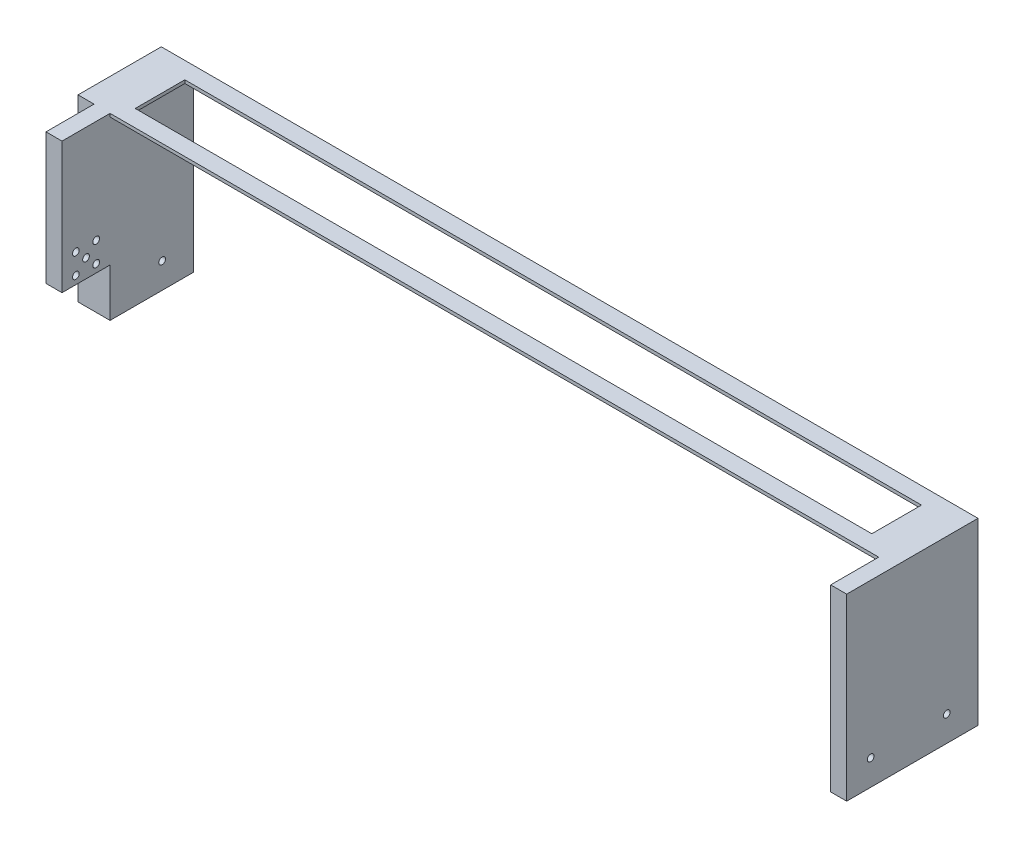
ISO-10303-21;
HEADER;
FILE_DESCRIPTION(('STEP AP214'),'2;1');
FILE_NAME('part.step','',(''),(''),'','','');
FILE_SCHEMA(('AUTOMOTIVE_DESIGN { 1 0 10303 214 1 1 1 1 }'));
ENDSEC;
DATA;
#1=APPLICATION_CONTEXT('core data for automotive mechanical design processes');
#2=APPLICATION_PROTOCOL_DEFINITION('international standard','automotive_design',2000,#1);
#3=PRODUCT_CONTEXT('',#1,'mechanical');
#4=PRODUCT('Part','Part','',(#3));
#5=PRODUCT_RELATED_PRODUCT_CATEGORY('part','',(#4));
#6=PRODUCT_DEFINITION_FORMATION('','',#4);
#7=PRODUCT_DEFINITION_CONTEXT('part definition',#1,'design');
#8=PRODUCT_DEFINITION('design','',#6,#7);
#9=PRODUCT_DEFINITION_SHAPE('','',#8);
#10=(LENGTH_UNIT() NAMED_UNIT(*) SI_UNIT(.MILLI.,.METRE.));
#11=(NAMED_UNIT(*) PLANE_ANGLE_UNIT() SI_UNIT($,.RADIAN.));
#12=(NAMED_UNIT(*) SI_UNIT($,.STERADIAN.) SOLID_ANGLE_UNIT());
#13=UNCERTAINTY_MEASURE_WITH_UNIT(LENGTH_MEASURE(1.E-05),#10,'distance_accuracy_value','');
#14=(GEOMETRIC_REPRESENTATION_CONTEXT(3) GLOBAL_UNCERTAINTY_ASSIGNED_CONTEXT((#13)) GLOBAL_UNIT_ASSIGNED_CONTEXT((#10,
#11,#12)) REPRESENTATION_CONTEXT('',''));
#15=CARTESIAN_POINT('',(0.,0.,0.));
#16=DIRECTION('',(0.,0.,1.));
#17=DIRECTION('',(1.,0.,0.));
#18=AXIS2_PLACEMENT_3D('',#15,#16,#17);
#19=CARTESIAN_POINT('',(0.,-0.001,0.));
#20=DIRECTION('',(0.,0.,1.));
#21=DIRECTION('',(1.,0.,0.));
#22=AXIS2_PLACEMENT_3D('',#19,#20,#21);
#23=PLANE('',#22);
#24=DIRECTION('',(0.,-1.,0.));
#25=VECTOR('',#24,1.);
#26=CARTESIAN_POINT('',(20.,-0.001,0.));
#27=LINE('',#26,#25);
#28=CARTESIAN_POINT('',(20.,79.999,0.));
#29=VERTEX_POINT('',#28);
#30=CARTESIAN_POINT('',(20.,-30.,0.));
#31=VERTEX_POINT('',#30);
#32=EDGE_CURVE('E234',#29,#31,#27,.T.);
#33=ORIENTED_EDGE('',*,*,#32,.T.);
#34=DIRECTION('',(-1.,0.,0.));
#35=VECTOR('',#34,1.);
#36=CARTESIAN_POINT('',(0.,-30.,0.));
#37=LINE('',#36,#35);
#38=CARTESIAN_POINT('',(0.,-30.,0.));
#39=VERTEX_POINT('',#38);
#40=EDGE_CURVE('E209',#31,#39,#37,.T.);
#41=ORIENTED_EDGE('',*,*,#40,.T.);
#42=DIRECTION('',(0.,1.,0.));
#43=VECTOR('',#42,1.);
#44=CARTESIAN_POINT('',(0.,-0.001,0.));
#45=LINE('',#44,#43);
#46=CARTESIAN_POINT('',(0.,82.,0.));
#47=VERTEX_POINT('',#46);
#48=EDGE_CURVE('E294',#39,#47,#45,.T.);
#49=ORIENTED_EDGE('',*,*,#48,.T.);
#50=DIRECTION('',(1.,0.,0.));
#51=VECTOR('',#50,1.);
#52=CARTESIAN_POINT('',(0.,82.,0.));
#53=LINE('',#52,#51);
#54=CARTESIAN_POINT('',(510.,82.,0.));
#55=VERTEX_POINT('',#54);
#56=EDGE_CURVE('E256',#47,#55,#53,.T.);
#57=ORIENTED_EDGE('',*,*,#56,.T.);
#58=DIRECTION('',(0.,1.,0.));
#59=VECTOR('',#58,1.);
#60=CARTESIAN_POINT('',(510.,-0.001,0.));
#61=LINE('',#60,#59);
#62=CARTESIAN_POINT('',(510.,-30.,0.));
#63=VERTEX_POINT('',#62);
#64=EDGE_CURVE('E292',#63,#55,#61,.T.);
#65=ORIENTED_EDGE('',*,*,#64,.F.);
#66=DIRECTION('',(-1.,0.,0.));
#67=VECTOR('',#66,1.);
#68=CARTESIAN_POINT('',(500.,-30.,0.));
#69=LINE('',#68,#67);
#70=CARTESIAN_POINT('',(500.,-30.,0.));
#71=VERTEX_POINT('',#70);
#72=EDGE_CURVE('E216',#63,#71,#69,.T.);
#73=ORIENTED_EDGE('',*,*,#72,.T.);
#74=DIRECTION('',(0.,1.,0.));
#75=VECTOR('',#74,1.);
#76=CARTESIAN_POINT('',(500.,79.999,0.));
#77=LINE('',#76,#75);
#78=CARTESIAN_POINT('',(500.,79.999,0.));
#79=VERTEX_POINT('',#78);
#80=EDGE_CURVE('E229',#71,#79,#77,.T.);
#81=ORIENTED_EDGE('',*,*,#80,.T.);
#82=DIRECTION('',(-1.,0.,0.));
#83=VECTOR('',#82,1.);
#84=CARTESIAN_POINT('',(20.,79.999,0.));
#85=LINE('',#84,#83);
#86=EDGE_CURVE('E231',#79,#29,#85,.T.);
#87=ORIENTED_EDGE('',*,*,#86,.T.);
#88=EDGE_LOOP('',(#33,#41,#49,#57,#65,#73,#81,#87));
#89=FACE_BOUND('',#88,.T.);
#90=ADVANCED_FACE('F39',(#89),#23,.F.);
#91=CARTESIAN_POINT('',(20.,-0.001,51.9999999999999));
#92=DIRECTION('',(0.,0.,1.));
#93=DIRECTION('',(1.,0.,0.));
#94=AXIS2_PLACEMENT_3D('',#91,#92,#93);
#95=PLANE('',#94);
#96=DIRECTION('',(0.,1.,0.));
#97=VECTOR('',#96,1.);
#98=CARTESIAN_POINT('',(20.,-0.001,51.9999999999999));
#99=LINE('',#98,#97);
#100=CARTESIAN_POINT('',(20.,79.999,51.9999999999999));
#101=VERTEX_POINT('',#100);
#102=CARTESIAN_POINT('',(20.,82.,51.9999999999999));
#103=VERTEX_POINT('',#102);
#104=EDGE_CURVE('E284',#101,#103,#99,.T.);
#105=ORIENTED_EDGE('',*,*,#104,.F.);
#106=DIRECTION('',(1.,0.,0.));
#107=VECTOR('',#106,1.);
#108=CARTESIAN_POINT('',(20.,79.999,51.9999999999999));
#109=LINE('',#108,#107);
#110=CARTESIAN_POINT('',(500.,79.999,51.9999999999999));
#111=VERTEX_POINT('',#110);
#112=EDGE_CURVE('E241',#101,#111,#109,.T.);
#113=ORIENTED_EDGE('',*,*,#112,.T.);
#114=DIRECTION('',(0.,1.,0.));
#115=VECTOR('',#114,1.);
#116=CARTESIAN_POINT('',(500.,-0.001,51.9999999999999));
#117=LINE('',#116,#115);
#118=CARTESIAN_POINT('',(500.,82.,51.9999999999999));
#119=VERTEX_POINT('',#118);
#120=EDGE_CURVE('E286',#111,#119,#117,.T.);
#121=ORIENTED_EDGE('',*,*,#120,.T.);
#122=DIRECTION('',(1.,0.,0.));
#123=VECTOR('',#122,1.);
#124=CARTESIAN_POINT('',(20.,82.,51.9999999999999));
#125=LINE('',#124,#123);
#126=EDGE_CURVE('E268',#103,#119,#125,.T.);
#127=ORIENTED_EDGE('',*,*,#126,.F.);
#128=EDGE_LOOP('',(#105,#113,#121,#127));
#129=FACE_BOUND('',#128,.T.);
#130=ADVANCED_FACE('F399',(#129),#95,.T.);
#131=CARTESIAN_POINT('',(0.,-0.001,0.));
#132=DIRECTION('',(0.,-1.,0.));
#133=DIRECTION('',(0.,0.,-1.));
#134=AXIS2_PLACEMENT_3D('',#131,#132,#133);
#135=PLANE('',#134);
#136=DIRECTION('',(-1.,0.,0.));
#137=VECTOR('',#136,1.);
#138=CARTESIAN_POINT('',(0.,-0.001,52.));
#139=LINE('',#138,#137);
#140=CARTESIAN_POINT('',(20.,-0.001,52.));
#141=VERTEX_POINT('',#140);
#142=CARTESIAN_POINT('',(10.,-0.001,52.));
#143=VERTEX_POINT('',#142);
#144=EDGE_CURVE('E215',#141,#143,#139,.T.);
#145=ORIENTED_EDGE('',*,*,#144,.F.);
#146=DIRECTION('',(0.,0.,-1.));
#147=VECTOR('',#146,1.);
#148=CARTESIAN_POINT('',(20.,-0.001,82.));
#149=LINE('',#148,#147);
#150=CARTESIAN_POINT('',(20.,-0.001,82.));
#151=VERTEX_POINT('',#150);
#152=EDGE_CURVE('E279',#151,#141,#149,.T.);
#153=ORIENTED_EDGE('',*,*,#152,.F.);
#154=DIRECTION('',(-1.,0.,0.));
#155=VECTOR('',#154,1.);
#156=CARTESIAN_POINT('',(20.,-0.001,82.));
#157=LINE('',#156,#155);
#158=CARTESIAN_POINT('',(10.,-0.001,82.));
#159=VERTEX_POINT('',#158);
#160=EDGE_CURVE('E274',#151,#159,#157,.T.);
#161=ORIENTED_EDGE('',*,*,#160,.T.);
#162=DIRECTION('',(0.,0.,-1.));
#163=VECTOR('',#162,1.);
#164=CARTESIAN_POINT('',(10.,-0.001,82.));
#165=LINE('',#164,#163);
#166=EDGE_CURVE('E277',#159,#143,#165,.T.);
#167=ORIENTED_EDGE('',*,*,#166,.T.);
#168=EDGE_LOOP('',(#145,#153,#161,#167));
#169=FACE_BOUND('',#168,.T.);
#170=ADVANCED_FACE('F403',(#169),#135,.T.);
#171=CARTESIAN_POINT('',(20.,-0.001,82.));
#172=DIRECTION('',(0.,0.,-1.));
#173=DIRECTION('',(-1.,0.,0.));
#174=AXIS2_PLACEMENT_3D('',#171,#172,#173);
#175=PLANE('',#174);
#176=DIRECTION('',(0.,1.,0.));
#177=VECTOR('',#176,1.);
#178=CARTESIAN_POINT('',(20.,-0.001,82.));
#179=LINE('',#178,#177);
#180=CARTESIAN_POINT('',(20.,82.,82.));
#181=VERTEX_POINT('',#180);
#182=EDGE_CURVE('E282',#151,#181,#179,.T.);
#183=ORIENTED_EDGE('',*,*,#182,.T.);
#184=DIRECTION('',(-1.,0.,0.));
#185=VECTOR('',#184,1.);
#186=CARTESIAN_POINT('',(20.,82.,82.));
#187=LINE('',#186,#185);
#188=CARTESIAN_POINT('',(10.,82.,82.));
#189=VERTEX_POINT('',#188);
#190=EDGE_CURVE('E244',#181,#189,#187,.T.);
#191=ORIENTED_EDGE('',*,*,#190,.T.);
#192=DIRECTION('',(0.,1.,0.));
#193=VECTOR('',#192,1.);
#194=CARTESIAN_POINT('',(10.,-0.001,82.));
#195=LINE('',#194,#193);
#196=EDGE_CURVE('E300',#159,#189,#195,.T.);
#197=ORIENTED_EDGE('',*,*,#196,.F.);
#198=ORIENTED_EDGE('',*,*,#160,.F.);
#199=EDGE_LOOP('',(#183,#191,#197,#198));
#200=FACE_BOUND('',#199,.T.);
#201=ADVANCED_FACE('F41',(#200),#175,.F.);
#202=CARTESIAN_POINT('',(10.,-0.001,82.));
#203=DIRECTION('',(1.,0.,0.));
#204=DIRECTION('',(0.,0.,-1.));
#205=AXIS2_PLACEMENT_3D('',#202,#203,#204);
#206=PLANE('',#205);
#207=CARTESIAN_POINT('',(10.,4.999,60.65));
#208=DIRECTION('',(1.,0.,0.));
#209=DIRECTION('',(0.,0.,-1.));
#210=AXIS2_PLACEMENT_3D('',#207,#208,#209);
#211=CIRCLE('',#210,2.09999999999999);
#212=CARTESIAN_POINT('',(10.,4.999,58.55));
#213=VERTEX_POINT('',#212);
#214=EDGE_CURVE('E325',#213,#213,#211,.T.);
#215=ORIENTED_EDGE('',*,*,#214,.T.);
#216=EDGE_LOOP('',(#215));
#217=FACE_BOUND('',#216,.T.);
#218=CARTESIAN_POINT('',(10.,4.999,73.35));
#219=DIRECTION('',(1.,0.,0.));
#220=DIRECTION('',(0.,0.,-1.));
#221=AXIS2_PLACEMENT_3D('',#218,#219,#220);
#222=CIRCLE('',#221,2.1);
#223=CARTESIAN_POINT('',(10.,4.999,71.25));
#224=VERTEX_POINT('',#223);
#225=EDGE_CURVE('E331',#224,#224,#222,.T.);
#226=ORIENTED_EDGE('',*,*,#225,.T.);
#227=EDGE_LOOP('',(#226));
#228=FACE_BOUND('',#227,.T.);
#229=CARTESIAN_POINT('',(10.,17.699,73.35));
#230=DIRECTION('',(1.,0.,0.));
#231=DIRECTION('',(0.,0.,-1.));
#232=AXIS2_PLACEMENT_3D('',#229,#230,#231);
#233=CIRCLE('',#232,2.09999999999999);
#234=CARTESIAN_POINT('',(10.,17.699,71.25));
#235=VERTEX_POINT('',#234);
#236=EDGE_CURVE('E337',#235,#235,#233,.T.);
#237=ORIENTED_EDGE('',*,*,#236,.T.);
#238=EDGE_LOOP('',(#237));
#239=FACE_BOUND('',#238,.T.);
#240=CARTESIAN_POINT('',(10.,17.699,60.65));
#241=DIRECTION('',(1.,0.,0.));
#242=DIRECTION('',(0.,0.,-1.));
#243=AXIS2_PLACEMENT_3D('',#240,#241,#242);
#244=CIRCLE('',#243,2.1);
#245=CARTESIAN_POINT('',(10.,17.699,58.55));
#246=VERTEX_POINT('',#245);
#247=EDGE_CURVE('E343',#246,#246,#244,.T.);
#248=ORIENTED_EDGE('',*,*,#247,.T.);
#249=EDGE_LOOP('',(#248));
#250=FACE_BOUND('',#249,.T.);
#251=CARTESIAN_POINT('',(10.,11.349,67.));
#252=DIRECTION('',(1.,0.,0.));
#253=DIRECTION('',(0.,0.,-1.));
#254=AXIS2_PLACEMENT_3D('',#251,#252,#253);
#255=CIRCLE('',#254,2.1);
#256=CARTESIAN_POINT('',(10.,11.349,64.9));
#257=VERTEX_POINT('',#256);
#258=EDGE_CURVE('E317',#257,#257,#255,.T.);
#259=ORIENTED_EDGE('',*,*,#258,.T.);
#260=EDGE_LOOP('',(#259));
#261=FACE_BOUND('',#260,.T.);
#262=ORIENTED_EDGE('',*,*,#196,.T.);
#263=DIRECTION('',(0.,0.,-1.));
#264=VECTOR('',#263,1.);
#265=CARTESIAN_POINT('',(10.,82.,82.));
#266=LINE('',#265,#264);
#267=CARTESIAN_POINT('',(10.,82.,52.));
#268=VERTEX_POINT('',#267);
#269=EDGE_CURVE('E247',#189,#268,#266,.T.);
#270=ORIENTED_EDGE('',*,*,#269,.T.);
#271=DIRECTION('',(0.,1.,0.));
#272=VECTOR('',#271,1.);
#273=CARTESIAN_POINT('',(10.,-0.001,52.));
#274=LINE('',#273,#272);
#275=EDGE_CURVE('E298',#143,#268,#274,.T.);
#276=ORIENTED_EDGE('',*,*,#275,.F.);
#277=ORIENTED_EDGE('',*,*,#166,.F.);
#278=EDGE_LOOP('',(#262,#270,#276,#277));
#279=FACE_BOUND('',#278,.T.);
#280=ADVANCED_FACE('F406',(#217,#228,#239,#250,#261,#279),#206,.F.);
#281=CARTESIAN_POINT('',(10.,-0.001,52.));
#282=DIRECTION('',(0.,0.,-1.));
#283=DIRECTION('',(-1.,0.,0.));
#284=AXIS2_PLACEMENT_3D('',#281,#282,#283);
#285=PLANE('',#284);
#286=DIRECTION('',(-1.,0.,0.));
#287=VECTOR('',#286,1.);
#288=CARTESIAN_POINT('',(10.,82.,52.));
#289=LINE('',#288,#287);
#290=CARTESIAN_POINT('',(0.,82.,52.));
#291=VERTEX_POINT('',#290);
#292=EDGE_CURVE('E250',#268,#291,#289,.T.);
#293=ORIENTED_EDGE('',*,*,#292,.T.);
#294=DIRECTION('',(0.,1.,0.));
#295=VECTOR('',#294,1.);
#296=CARTESIAN_POINT('',(0.,-0.001,52.));
#297=LINE('',#296,#295);
#298=CARTESIAN_POINT('',(0.,-30.,52.));
#299=VERTEX_POINT('',#298);
#300=EDGE_CURVE('E296',#299,#291,#297,.T.);
#301=ORIENTED_EDGE('',*,*,#300,.F.);
#302=DIRECTION('',(1.,0.,0.));
#303=VECTOR('',#302,1.);
#304=CARTESIAN_POINT('',(0.,-30.,52.));
#305=LINE('',#304,#303);
#306=CARTESIAN_POINT('',(20.,-30.,52.));
#307=VERTEX_POINT('',#306);
#308=EDGE_CURVE('E202',#299,#307,#305,.T.);
#309=ORIENTED_EDGE('',*,*,#308,.T.);
#310=DIRECTION('',(0.,1.,0.));
#311=VECTOR('',#310,1.);
#312=CARTESIAN_POINT('',(20.,-30.,52.));
#313=LINE('',#312,#311);
#314=EDGE_CURVE('E212',#307,#141,#313,.T.);
#315=ORIENTED_EDGE('',*,*,#314,.T.);
#316=ORIENTED_EDGE('',*,*,#144,.T.);
#317=ORIENTED_EDGE('',*,*,#275,.T.);
#318=EDGE_LOOP('',(#293,#301,#309,#315,#316,#317));
#319=FACE_BOUND('',#318,.T.);
#320=ADVANCED_FACE('F367',(#319),#285,.F.);
#321=CARTESIAN_POINT('',(0.,-0.001,52.));
#322=DIRECTION('',(1.,0.,0.));
#323=DIRECTION('',(0.,0.,-1.));
#324=AXIS2_PLACEMENT_3D('',#321,#322,#323);
#325=PLANE('',#324);
#326=CARTESIAN_POINT('',(0.,-14.05,19.5000000104647));
#327=DIRECTION('',(1.,0.,0.));
#328=DIRECTION('',(0.,0.,-1.));
#329=AXIS2_PLACEMENT_3D('',#326,#327,#328);
#330=CIRCLE('',#329,2.1);
#331=CARTESIAN_POINT('',(0.,-14.05,17.4000000104647));
#332=VERTEX_POINT('',#331);
#333=EDGE_CURVE('E195',#332,#332,#330,.T.);
#334=ORIENTED_EDGE('',*,*,#333,.T.);
#335=EDGE_LOOP('',(#334));
#336=FACE_BOUND('',#335,.T.);
#337=DIRECTION('',(0.,0.,-1.));
#338=VECTOR('',#337,1.);
#339=CARTESIAN_POINT('',(0.,82.,52.));
#340=LINE('',#339,#338);
#341=EDGE_CURVE('E253',#291,#47,#340,.T.);
#342=ORIENTED_EDGE('',*,*,#341,.T.);
#343=ORIENTED_EDGE('',*,*,#48,.F.);
#344=DIRECTION('',(0.,0.,1.));
#345=VECTOR('',#344,1.);
#346=CARTESIAN_POINT('',(0.,-30.,0.));
#347=LINE('',#346,#345);
#348=EDGE_CURVE('E199',#39,#299,#347,.T.);
#349=ORIENTED_EDGE('',*,*,#348,.T.);
#350=ORIENTED_EDGE('',*,*,#300,.T.);
#351=EDGE_LOOP('',(#342,#343,#349,#350));
#352=FACE_BOUND('',#351,.T.);
#353=ADVANCED_FACE('F374',(#336,#352),#325,.F.);
#354=CARTESIAN_POINT('',(510.,-0.001,0.));
#355=DIRECTION('',(-1.,0.,0.));
#356=DIRECTION('',(0.,0.,1.));
#357=AXIS2_PLACEMENT_3D('',#354,#355,#356);
#358=PLANE('',#357);
#359=CARTESIAN_POINT('',(510.,-14.0509999998966,66.9999999999384));
#360=DIRECTION('',(1.,0.,0.));
#361=DIRECTION('',(0.,0.,-1.));
#362=AXIS2_PLACEMENT_3D('',#359,#360,#361);
#363=CIRCLE('',#362,2.1);
#364=CARTESIAN_POINT('',(510.,-14.0509999998966,64.8999999999384));
#365=VERTEX_POINT('',#364);
#366=EDGE_CURVE('E186',#365,#365,#363,.T.);
#367=ORIENTED_EDGE('',*,*,#366,.F.);
#368=EDGE_LOOP('',(#367));
#369=FACE_BOUND('',#368,.T.);
#370=CARTESIAN_POINT('',(510.,-14.05,19.5000000104647));
#371=DIRECTION('',(1.,0.,0.));
#372=DIRECTION('',(0.,0.,-1.));
#373=AXIS2_PLACEMENT_3D('',#370,#371,#372);
#374=CIRCLE('',#373,2.1);
#375=CARTESIAN_POINT('',(510.,-14.05,17.4000000104647));
#376=VERTEX_POINT('',#375);
#377=EDGE_CURVE('E183',#376,#376,#374,.T.);
#378=ORIENTED_EDGE('',*,*,#377,.F.);
#379=EDGE_LOOP('',(#378));
#380=FACE_BOUND('',#379,.T.);
#381=DIRECTION('',(0.,0.,1.));
#382=VECTOR('',#381,1.);
#383=CARTESIAN_POINT('',(510.,82.,0.));
#384=LINE('',#383,#382);
#385=CARTESIAN_POINT('',(510.,82.,81.9999999999999));
#386=VERTEX_POINT('',#385);
#387=EDGE_CURVE('E259',#55,#386,#384,.T.);
#388=ORIENTED_EDGE('',*,*,#387,.T.);
#389=DIRECTION('',(0.,1.,0.));
#390=VECTOR('',#389,1.);
#391=CARTESIAN_POINT('',(510.,-0.001,81.9999999999999));
#392=LINE('',#391,#390);
#393=CARTESIAN_POINT('',(510.,-30.,81.9999999999999));
#394=VERTEX_POINT('',#393);
#395=EDGE_CURVE('E290',#394,#386,#392,.T.);
#396=ORIENTED_EDGE('',*,*,#395,.F.);
#397=DIRECTION('',(0.,0.,-1.));
#398=VECTOR('',#397,1.);
#399=CARTESIAN_POINT('',(510.,-30.,0.));
#400=LINE('',#399,#398);
#401=EDGE_CURVE('E219',#394,#63,#400,.T.);
#402=ORIENTED_EDGE('',*,*,#401,.T.);
#403=ORIENTED_EDGE('',*,*,#64,.T.);
#404=EDGE_LOOP('',(#388,#396,#402,#403));
#405=FACE_BOUND('',#404,.T.);
#406=ADVANCED_FACE('F383',(#369,#380,#405),#358,.F.);
#407=CARTESIAN_POINT('',(510.,-0.001,81.9999999999999));
#408=DIRECTION('',(0.,0.,-1.));
#409=DIRECTION('',(-1.,0.,0.));
#410=AXIS2_PLACEMENT_3D('',#407,#408,#409);
#411=PLANE('',#410);
#412=DIRECTION('',(-1.,0.,0.));
#413=VECTOR('',#412,1.);
#414=CARTESIAN_POINT('',(510.,82.,81.9999999999999));
#415=LINE('',#414,#413);
#416=CARTESIAN_POINT('',(500.,82.,81.9999999999999));
#417=VERTEX_POINT('',#416);
#418=EDGE_CURVE('E262',#386,#417,#415,.T.);
#419=ORIENTED_EDGE('',*,*,#418,.T.);
#420=DIRECTION('',(0.,1.,0.));
#421=VECTOR('',#420,1.);
#422=CARTESIAN_POINT('',(500.,-0.001,81.9999999999999));
#423=LINE('',#422,#421);
#424=CARTESIAN_POINT('',(500.,-30.,81.9999999999999));
#425=VERTEX_POINT('',#424);
#426=EDGE_CURVE('E288',#425,#417,#423,.T.);
#427=ORIENTED_EDGE('',*,*,#426,.F.);
#428=DIRECTION('',(1.,0.,0.));
#429=VECTOR('',#428,1.);
#430=CARTESIAN_POINT('',(500.,-30.,81.9999999999999));
#431=LINE('',#430,#429);
#432=EDGE_CURVE('E222',#425,#394,#431,.T.);
#433=ORIENTED_EDGE('',*,*,#432,.T.);
#434=ORIENTED_EDGE('',*,*,#395,.T.);
#435=EDGE_LOOP('',(#419,#427,#433,#434));
#436=FACE_BOUND('',#435,.T.);
#437=ADVANCED_FACE('F432',(#436),#411,.F.);
#438=CARTESIAN_POINT('',(500.,-0.001,51.9999999999999));
#439=DIRECTION('',(-1.,0.,0.));
#440=DIRECTION('',(0.,0.,1.));
#441=AXIS2_PLACEMENT_3D('',#438,#439,#440);
#442=PLANE('',#441);
#443=CARTESIAN_POINT('',(500.,-14.0509999998966,66.9999999999384));
#444=DIRECTION('',(-1.,0.,0.));
#445=DIRECTION('',(0.,0.,1.));
#446=AXIS2_PLACEMENT_3D('',#443,#444,#445);
#447=CIRCLE('',#446,2.1);
#448=CARTESIAN_POINT('',(500.,-14.0509999998966,69.0999999999384));
#449=VERTEX_POINT('',#448);
#450=EDGE_CURVE('E198',#449,#449,#447,.T.);
#451=ORIENTED_EDGE('',*,*,#450,.F.);
#452=EDGE_LOOP('',(#451));
#453=FACE_BOUND('',#452,.T.);
#454=CARTESIAN_POINT('',(500.,-14.05,19.5000000104647));
#455=DIRECTION('',(-1.,0.,0.));
#456=DIRECTION('',(0.,0.,1.));
#457=AXIS2_PLACEMENT_3D('',#454,#455,#456);
#458=CIRCLE('',#457,2.1);
#459=CARTESIAN_POINT('',(500.,-14.05,21.6000000104648));
#460=VERTEX_POINT('',#459);
#461=EDGE_CURVE('E192',#460,#460,#458,.T.);
#462=ORIENTED_EDGE('',*,*,#461,.F.);
#463=EDGE_LOOP('',(#462));
#464=FACE_BOUND('',#463,.T.);
#465=DIRECTION('',(0.,0.,-1.));
#466=VECTOR('',#465,1.);
#467=CARTESIAN_POINT('',(500.,79.999,82.));
#468=LINE('',#467,#466);
#469=EDGE_CURVE('E238',#111,#79,#468,.T.);
#470=ORIENTED_EDGE('',*,*,#469,.T.);
#471=ORIENTED_EDGE('',*,*,#80,.F.);
#472=DIRECTION('',(0.,0.,1.));
#473=VECTOR('',#472,1.);
#474=CARTESIAN_POINT('',(500.,-30.,0.));
#475=LINE('',#474,#473);
#476=EDGE_CURVE('E203',#71,#425,#475,.T.);
#477=ORIENTED_EDGE('',*,*,#476,.T.);
#478=ORIENTED_EDGE('',*,*,#426,.T.);
#479=DIRECTION('',(0.,0.,1.));
#480=VECTOR('',#479,1.);
#481=CARTESIAN_POINT('',(500.,82.,51.9999999999999));
#482=LINE('',#481,#480);
#483=EDGE_CURVE('E265',#119,#417,#482,.T.);
#484=ORIENTED_EDGE('',*,*,#483,.F.);
#485=ORIENTED_EDGE('',*,*,#120,.F.);
#486=EDGE_LOOP('',(#470,#471,#477,#478,#484,#485));
#487=FACE_BOUND('',#486,.T.);
#488=ADVANCED_FACE('F354',(#453,#464,#487),#442,.T.);
#489=CARTESIAN_POINT('',(20.,-0.001,82.));
#490=DIRECTION('',(1.,0.,0.));
#491=DIRECTION('',(0.,0.,-1.));
#492=AXIS2_PLACEMENT_3D('',#489,#490,#491);
#493=PLANE('',#492);
#494=CARTESIAN_POINT('',(20.,4.999,60.65));
#495=DIRECTION('',(1.,0.,0.));
#496=DIRECTION('',(0.,0.,-1.));
#497=AXIS2_PLACEMENT_3D('',#494,#495,#496);
#498=CIRCLE('',#497,2.09999999999999);
#499=CARTESIAN_POINT('',(20.,4.999,58.55));
#500=VERTEX_POINT('',#499);
#501=EDGE_CURVE('E328',#500,#500,#498,.T.);
#502=ORIENTED_EDGE('',*,*,#501,.F.);
#503=EDGE_LOOP('',(#502));
#504=FACE_BOUND('',#503,.T.);
#505=CARTESIAN_POINT('',(20.,4.999,73.35));
#506=DIRECTION('',(1.,0.,0.));
#507=DIRECTION('',(0.,0.,-1.));
#508=AXIS2_PLACEMENT_3D('',#505,#506,#507);
#509=CIRCLE('',#508,2.1);
#510=CARTESIAN_POINT('',(20.,4.999,71.25));
#511=VERTEX_POINT('',#510);
#512=EDGE_CURVE('E334',#511,#511,#509,.T.);
#513=ORIENTED_EDGE('',*,*,#512,.F.);
#514=EDGE_LOOP('',(#513));
#515=FACE_BOUND('',#514,.T.);
#516=CARTESIAN_POINT('',(20.,17.699,73.35));
#517=DIRECTION('',(1.,0.,0.));
#518=DIRECTION('',(0.,0.,-1.));
#519=AXIS2_PLACEMENT_3D('',#516,#517,#518);
#520=CIRCLE('',#519,2.09999999999999);
#521=CARTESIAN_POINT('',(20.,17.699,71.25));
#522=VERTEX_POINT('',#521);
#523=EDGE_CURVE('E340',#522,#522,#520,.T.);
#524=ORIENTED_EDGE('',*,*,#523,.F.);
#525=EDGE_LOOP('',(#524));
#526=FACE_BOUND('',#525,.T.);
#527=CARTESIAN_POINT('',(20.,17.699,60.65));
#528=DIRECTION('',(1.,0.,0.));
#529=DIRECTION('',(0.,0.,-1.));
#530=AXIS2_PLACEMENT_3D('',#527,#528,#529);
#531=CIRCLE('',#530,2.1);
#532=CARTESIAN_POINT('',(20.,17.699,58.55));
#533=VERTEX_POINT('',#532);
#534=EDGE_CURVE('E323',#533,#533,#531,.T.);
#535=ORIENTED_EDGE('',*,*,#534,.F.);
#536=EDGE_LOOP('',(#535));
#537=FACE_BOUND('',#536,.T.);
#538=CARTESIAN_POINT('',(20.,11.349,67.));
#539=DIRECTION('',(1.,0.,0.));
#540=DIRECTION('',(0.,0.,-1.));
#541=AXIS2_PLACEMENT_3D('',#538,#539,#540);
#542=CIRCLE('',#541,2.1);
#543=CARTESIAN_POINT('',(20.,11.349,64.9));
#544=VERTEX_POINT('',#543);
#545=EDGE_CURVE('E319',#544,#544,#542,.T.);
#546=ORIENTED_EDGE('',*,*,#545,.F.);
#547=EDGE_LOOP('',(#546));
#548=FACE_BOUND('',#547,.T.);
#549=CARTESIAN_POINT('',(20.,-14.05,19.5000000104647));
#550=DIRECTION('',(1.,0.,0.));
#551=DIRECTION('',(0.,0.,-1.));
#552=AXIS2_PLACEMENT_3D('',#549,#550,#551);
#553=CIRCLE('',#552,2.1);
#554=CARTESIAN_POINT('',(20.,-14.05,17.4000000104647));
#555=VERTEX_POINT('',#554);
#556=EDGE_CURVE('E189',#555,#555,#553,.T.);
#557=ORIENTED_EDGE('',*,*,#556,.F.);
#558=EDGE_LOOP('',(#557));
#559=FACE_BOUND('',#558,.T.);
#560=ORIENTED_EDGE('',*,*,#152,.T.);
#561=ORIENTED_EDGE('',*,*,#314,.F.);
#562=DIRECTION('',(0.,0.,-1.));
#563=VECTOR('',#562,1.);
#564=CARTESIAN_POINT('',(20.,-30.,0.));
#565=LINE('',#564,#563);
#566=EDGE_CURVE('E206',#307,#31,#565,.T.);
#567=ORIENTED_EDGE('',*,*,#566,.T.);
#568=ORIENTED_EDGE('',*,*,#32,.F.);
#569=DIRECTION('',(0.,0.,-1.));
#570=VECTOR('',#569,1.);
#571=CARTESIAN_POINT('',(20.,79.999,82.));
#572=LINE('',#571,#570);
#573=EDGE_CURVE('E236',#101,#29,#572,.T.);
#574=ORIENTED_EDGE('',*,*,#573,.F.);
#575=ORIENTED_EDGE('',*,*,#104,.T.);
#576=DIRECTION('',(0.,0.,-1.));
#577=VECTOR('',#576,1.);
#578=CARTESIAN_POINT('',(20.,82.,82.));
#579=LINE('',#578,#577);
#580=EDGE_CURVE('E271',#181,#103,#579,.T.);
#581=ORIENTED_EDGE('',*,*,#580,.F.);
#582=ORIENTED_EDGE('',*,*,#182,.F.);
#583=EDGE_LOOP('',(#560,#561,#567,#568,#574,#575,#581,#582));
#584=FACE_BOUND('',#583,.T.);
#585=ADVANCED_FACE('F351',(#504,#515,#526,#537,#548,#559,#584),#493,.T.);
#586=CARTESIAN_POINT('',(0.,82.,0.));
#587=DIRECTION('',(0.,-1.,0.));
#588=DIRECTION('',(0.,0.,-1.));
#589=AXIS2_PLACEMENT_3D('',#586,#587,#588);
#590=PLANE('',#589);
#591=DIRECTION('',(1.,0.,0.));
#592=VECTOR('',#591,1.);
#593=CARTESIAN_POINT('',(25.2000000000149,82.,41.4999999999999));
#594=LINE('',#593,#592);
#595=CARTESIAN_POINT('',(25.2000000000149,82.,41.4999999999999));
#596=VERTEX_POINT('',#595);
#597=CARTESIAN_POINT('',(485.200000001051,82.,41.4999999999999));
#598=VERTEX_POINT('',#597);
#599=EDGE_CURVE('E169',#596,#598,#594,.T.);
#600=ORIENTED_EDGE('',*,*,#599,.F.);
#601=DIRECTION('',(0.,0.,1.));
#602=VECTOR('',#601,1.);
#603=CARTESIAN_POINT('',(25.2000000000149,82.,10.4999999999999));
#604=LINE('',#603,#602);
#605=CARTESIAN_POINT('',(25.2000000000149,82.,10.4999999999999));
#606=VERTEX_POINT('',#605);
#607=EDGE_CURVE('E54',#606,#596,#604,.T.);
#608=ORIENTED_EDGE('',*,*,#607,.F.);
#609=DIRECTION('',(-1.,0.,0.));
#610=VECTOR('',#609,1.);
#611=CARTESIAN_POINT('',(25.2000000000149,82.,10.4999999999999));
#612=LINE('',#611,#610);
#613=CARTESIAN_POINT('',(485.200000001051,82.,10.4999999999999));
#614=VERTEX_POINT('',#613);
#615=EDGE_CURVE('E176',#614,#606,#612,.T.);
#616=ORIENTED_EDGE('',*,*,#615,.F.);
#617=DIRECTION('',(0.,0.,-1.));
#618=VECTOR('',#617,1.);
#619=CARTESIAN_POINT('',(485.200000001051,82.,41.4999999999999));
#620=LINE('',#619,#618);
#621=EDGE_CURVE('E160',#598,#614,#620,.T.);
#622=ORIENTED_EDGE('',*,*,#621,.F.);
#623=EDGE_LOOP('',(#600,#608,#616,#622));
#624=FACE_BOUND('',#623,.T.);
#625=ORIENTED_EDGE('',*,*,#190,.F.);
#626=ORIENTED_EDGE('',*,*,#580,.T.);
#627=ORIENTED_EDGE('',*,*,#126,.T.);
#628=ORIENTED_EDGE('',*,*,#483,.T.);
#629=ORIENTED_EDGE('',*,*,#418,.F.);
#630=ORIENTED_EDGE('',*,*,#387,.F.);
#631=ORIENTED_EDGE('',*,*,#56,.F.);
#632=ORIENTED_EDGE('',*,*,#341,.F.);
#633=ORIENTED_EDGE('',*,*,#292,.F.);
#634=ORIENTED_EDGE('',*,*,#269,.F.);
#635=EDGE_LOOP('',(#625,#626,#627,#628,#629,#630,#631,#632,#633,#634));
#636=FACE_BOUND('',#635,.T.);
#637=ADVANCED_FACE('F173',(#624,#636),#590,.F.);
#638=CARTESIAN_POINT('',(20.,79.999,82.));
#639=DIRECTION('',(0.,-1.,0.));
#640=DIRECTION('',(0.,0.,-1.));
#641=AXIS2_PLACEMENT_3D('',#638,#639,#640);
#642=PLANE('',#641);
#643=DIRECTION('',(0.,0.,-1.));
#644=VECTOR('',#643,1.);
#645=CARTESIAN_POINT('',(25.2000000000149,79.999,82.));
#646=LINE('',#645,#644);
#647=CARTESIAN_POINT('',(25.2000000000149,79.999,41.4999999999999));
#648=VERTEX_POINT('',#647);
#649=CARTESIAN_POINT('',(25.2000000000149,79.999,10.4999999999999));
#650=VERTEX_POINT('',#649);
#651=EDGE_CURVE('E11',#648,#650,#646,.T.);
#652=ORIENTED_EDGE('',*,*,#651,.F.);
#653=DIRECTION('',(-1.,0.,0.));
#654=VECTOR('',#653,1.);
#655=CARTESIAN_POINT('',(20.,79.999,41.4999999999999));
#656=LINE('',#655,#654);
#657=CARTESIAN_POINT('',(485.200000001051,79.999,41.4999999999999));
#658=VERTEX_POINT('',#657);
#659=EDGE_CURVE('E302',#658,#648,#656,.T.);
#660=ORIENTED_EDGE('',*,*,#659,.F.);
#661=DIRECTION('',(0.,0.,1.));
#662=VECTOR('',#661,1.);
#663=CARTESIAN_POINT('',(485.200000001051,79.999,81.9999999999992));
#664=LINE('',#663,#662);
#665=CARTESIAN_POINT('',(485.200000001051,79.999,10.4999999999999));
#666=VERTEX_POINT('',#665);
#667=EDGE_CURVE('E163',#666,#658,#664,.T.);
#668=ORIENTED_EDGE('',*,*,#667,.F.);
#669=DIRECTION('',(1.,0.,0.));
#670=VECTOR('',#669,1.);
#671=CARTESIAN_POINT('',(20.,79.999,10.4999999999999));
#672=LINE('',#671,#670);
#673=EDGE_CURVE('E47',#650,#666,#672,.T.);
#674=ORIENTED_EDGE('',*,*,#673,.F.);
#675=EDGE_LOOP('',(#652,#660,#668,#674));
#676=FACE_BOUND('',#675,.T.);
#677=ORIENTED_EDGE('',*,*,#573,.T.);
#678=ORIENTED_EDGE('',*,*,#86,.F.);
#679=ORIENTED_EDGE('',*,*,#469,.F.);
#680=ORIENTED_EDGE('',*,*,#112,.F.);
#681=EDGE_LOOP('',(#677,#678,#679,#680));
#682=FACE_BOUND('',#681,.T.);
#683=ADVANCED_FACE('F314',(#676,#682),#642,.T.);
#684=CARTESIAN_POINT('',(0.,-30.,0.));
#685=DIRECTION('',(0.,1.,0.));
#686=DIRECTION('',(0.,0.,1.));
#687=AXIS2_PLACEMENT_3D('',#684,#685,#686);
#688=PLANE('',#687);
#689=ORIENTED_EDGE('',*,*,#348,.F.);
#690=ORIENTED_EDGE('',*,*,#40,.F.);
#691=ORIENTED_EDGE('',*,*,#566,.F.);
#692=ORIENTED_EDGE('',*,*,#308,.F.);
#693=EDGE_LOOP('',(#689,#690,#691,#692));
#694=FACE_BOUND('',#693,.T.);
#695=ADVANCED_FACE('F371',(#694),#688,.F.);
#696=CARTESIAN_POINT('',(0.,-30.,0.));
#697=DIRECTION('',(0.,1.,0.));
#698=DIRECTION('',(0.,0.,1.));
#699=AXIS2_PLACEMENT_3D('',#696,#697,#698);
#700=PLANE('',#699);
#701=ORIENTED_EDGE('',*,*,#476,.F.);
#702=ORIENTED_EDGE('',*,*,#72,.F.);
#703=ORIENTED_EDGE('',*,*,#401,.F.);
#704=ORIENTED_EDGE('',*,*,#432,.F.);
#705=EDGE_LOOP('',(#701,#702,#703,#704));
#706=FACE_BOUND('',#705,.T.);
#707=ADVANCED_FACE('F388',(#706),#700,.F.);
#708=CARTESIAN_POINT('',(-108.,-14.05,19.5000000104647));
#709=DIRECTION('',(1.,0.,0.));
#710=DIRECTION('',(0.,0.,-1.));
#711=AXIS2_PLACEMENT_3D('',#708,#709,#710);
#712=CYLINDRICAL_SURFACE('',#711,2.1);
#713=ORIENTED_EDGE('',*,*,#556,.T.);
#714=EDGE_LOOP('',(#713));
#715=FACE_BOUND('',#714,.T.);
#716=ORIENTED_EDGE('',*,*,#333,.F.);
#717=EDGE_LOOP('',(#716));
#718=FACE_BOUND('',#717,.T.);
#719=ADVANCED_FACE('F436',(#715,#718),#712,.F.);
#720=ORIENTED_EDGE('',*,*,#461,.T.);
#721=EDGE_LOOP('',(#720));
#722=FACE_BOUND('',#721,.T.);
#723=ORIENTED_EDGE('',*,*,#377,.T.);
#724=EDGE_LOOP('',(#723));
#725=FACE_BOUND('',#724,.T.);
#726=ADVANCED_FACE('F438',(#722,#725),#712,.F.);
#727=CARTESIAN_POINT('',(-108.,-14.0509999998966,66.9999999999384));
#728=DIRECTION('',(1.,0.,0.));
#729=DIRECTION('',(0.,0.,-1.));
#730=AXIS2_PLACEMENT_3D('',#727,#728,#729);
#731=CYLINDRICAL_SURFACE('',#730,2.1);
#732=ORIENTED_EDGE('',*,*,#450,.T.);
#733=EDGE_LOOP('',(#732));
#734=FACE_BOUND('',#733,.T.);
#735=ORIENTED_EDGE('',*,*,#366,.T.);
#736=EDGE_LOOP('',(#735));
#737=FACE_BOUND('',#736,.T.);
#738=ADVANCED_FACE('F445',(#734,#737),#731,.F.);
#739=CARTESIAN_POINT('',(25.2000000000149,40.,10.4999999999999));
#740=DIRECTION('',(-1.,0.,0.));
#741=DIRECTION('',(0.,0.,1.));
#742=AXIS2_PLACEMENT_3D('',#739,#740,#741);
#743=PLANE('',#742);
#744=ORIENTED_EDGE('',*,*,#651,.T.);
#745=DIRECTION('',(0.,1.,0.));
#746=VECTOR('',#745,1.);
#747=CARTESIAN_POINT('',(25.2000000000149,40.,10.4999999999999));
#748=LINE('',#747,#746);
#749=EDGE_CURVE('E181',#650,#606,#748,.T.);
#750=ORIENTED_EDGE('',*,*,#749,.T.);
#751=ORIENTED_EDGE('',*,*,#607,.T.);
#752=DIRECTION('',(0.,1.,0.));
#753=VECTOR('',#752,1.);
#754=CARTESIAN_POINT('',(25.2000000000149,40.,41.4999999999999));
#755=LINE('',#754,#753);
#756=EDGE_CURVE('E166',#648,#596,#755,.T.);
#757=ORIENTED_EDGE('',*,*,#756,.F.);
#758=EDGE_LOOP('',(#744,#750,#751,#757));
#759=FACE_BOUND('',#758,.T.);
#760=ADVANCED_FACE('F316',(#759),#743,.F.);
#761=CARTESIAN_POINT('',(25.2000000000149,40.,10.4999999999999));
#762=DIRECTION('',(0.,0.,-1.));
#763=DIRECTION('',(-1.,0.,0.));
#764=AXIS2_PLACEMENT_3D('',#761,#762,#763);
#765=PLANE('',#764);
#766=ORIENTED_EDGE('',*,*,#673,.T.);
#767=DIRECTION('',(0.,1.,0.));
#768=VECTOR('',#767,1.);
#769=CARTESIAN_POINT('',(485.200000001051,40.,10.4999999999999));
#770=LINE('',#769,#768);
#771=EDGE_CURVE('E165',#666,#614,#770,.T.);
#772=ORIENTED_EDGE('',*,*,#771,.T.);
#773=ORIENTED_EDGE('',*,*,#615,.T.);
#774=ORIENTED_EDGE('',*,*,#749,.F.);
#775=EDGE_LOOP('',(#766,#772,#773,#774));
#776=FACE_BOUND('',#775,.T.);
#777=ADVANCED_FACE('F311',(#776),#765,.F.);
#778=CARTESIAN_POINT('',(485.200000001051,40.,41.4999999999999));
#779=DIRECTION('',(1.,0.,0.));
#780=DIRECTION('',(0.,0.,-1.));
#781=AXIS2_PLACEMENT_3D('',#778,#779,#780);
#782=PLANE('',#781);
#783=ORIENTED_EDGE('',*,*,#667,.T.);
#784=DIRECTION('',(0.,1.,0.));
#785=VECTOR('',#784,1.);
#786=CARTESIAN_POINT('',(485.200000001051,40.,41.4999999999999));
#787=LINE('',#786,#785);
#788=EDGE_CURVE('E62',#658,#598,#787,.T.);
#789=ORIENTED_EDGE('',*,*,#788,.T.);
#790=ORIENTED_EDGE('',*,*,#621,.T.);
#791=ORIENTED_EDGE('',*,*,#771,.F.);
#792=EDGE_LOOP('',(#783,#789,#790,#791));
#793=FACE_BOUND('',#792,.T.);
#794=ADVANCED_FACE('F157',(#793),#782,.F.);
#795=CARTESIAN_POINT('',(25.2000000000149,40.,41.4999999999999));
#796=DIRECTION('',(0.,0.,1.));
#797=DIRECTION('',(1.,0.,0.));
#798=AXIS2_PLACEMENT_3D('',#795,#796,#797);
#799=PLANE('',#798);
#800=ORIENTED_EDGE('',*,*,#659,.T.);
#801=ORIENTED_EDGE('',*,*,#756,.T.);
#802=ORIENTED_EDGE('',*,*,#599,.T.);
#803=ORIENTED_EDGE('',*,*,#788,.F.);
#804=EDGE_LOOP('',(#800,#801,#802,#803));
#805=FACE_BOUND('',#804,.T.);
#806=ADVANCED_FACE('F170',(#805),#799,.F.);
#807=CARTESIAN_POINT('',(10.,11.349,67.));
#808=DIRECTION('',(1.,0.,0.));
#809=DIRECTION('',(0.,0.,-1.));
#810=AXIS2_PLACEMENT_3D('',#807,#808,#809);
#811=CYLINDRICAL_SURFACE('',#810,2.1);
#812=ORIENTED_EDGE('',*,*,#258,.F.);
#813=EDGE_LOOP('',(#812));
#814=FACE_BOUND('',#813,.T.);
#815=ORIENTED_EDGE('',*,*,#545,.T.);
#816=EDGE_LOOP('',(#815));
#817=FACE_BOUND('',#816,.T.);
#818=ADVANCED_FACE('F528',(#814,#817),#811,.F.);
#819=CARTESIAN_POINT('',(10.,17.699,60.65));
#820=DIRECTION('',(1.,0.,0.));
#821=DIRECTION('',(0.,0.,-1.));
#822=AXIS2_PLACEMENT_3D('',#819,#820,#821);
#823=CYLINDRICAL_SURFACE('',#822,2.1);
#824=ORIENTED_EDGE('',*,*,#247,.F.);
#825=EDGE_LOOP('',(#824));
#826=FACE_BOUND('',#825,.T.);
#827=ORIENTED_EDGE('',*,*,#534,.T.);
#828=EDGE_LOOP('',(#827));
#829=FACE_BOUND('',#828,.T.);
#830=ADVANCED_FACE('F349',(#826,#829),#823,.F.);
#831=CARTESIAN_POINT('',(10.,17.699,73.35));
#832=DIRECTION('',(1.,0.,0.));
#833=DIRECTION('',(0.,0.,-1.));
#834=AXIS2_PLACEMENT_3D('',#831,#832,#833);
#835=CYLINDRICAL_SURFACE('',#834,2.09999999999999);
#836=ORIENTED_EDGE('',*,*,#236,.F.);
#837=EDGE_LOOP('',(#836));
#838=FACE_BOUND('',#837,.T.);
#839=ORIENTED_EDGE('',*,*,#523,.T.);
#840=EDGE_LOOP('',(#839));
#841=FACE_BOUND('',#840,.T.);
#842=ADVANCED_FACE('F546',(#838,#841),#835,.F.);
#843=CARTESIAN_POINT('',(10.,4.999,73.35));
#844=DIRECTION('',(1.,0.,0.));
#845=DIRECTION('',(0.,0.,-1.));
#846=AXIS2_PLACEMENT_3D('',#843,#844,#845);
#847=CYLINDRICAL_SURFACE('',#846,2.1);
#848=ORIENTED_EDGE('',*,*,#225,.F.);
#849=EDGE_LOOP('',(#848));
#850=FACE_BOUND('',#849,.T.);
#851=ORIENTED_EDGE('',*,*,#512,.T.);
#852=EDGE_LOOP('',(#851));
#853=FACE_BOUND('',#852,.T.);
#854=ADVANCED_FACE('F556',(#850,#853),#847,.F.);
#855=CARTESIAN_POINT('',(10.,4.999,60.65));
#856=DIRECTION('',(1.,0.,0.));
#857=DIRECTION('',(0.,0.,-1.));
#858=AXIS2_PLACEMENT_3D('',#855,#856,#857);
#859=CYLINDRICAL_SURFACE('',#858,2.09999999999999);
#860=ORIENTED_EDGE('',*,*,#214,.F.);
#861=EDGE_LOOP('',(#860));
#862=FACE_BOUND('',#861,.T.);
#863=ORIENTED_EDGE('',*,*,#501,.T.);
#864=EDGE_LOOP('',(#863));
#865=FACE_BOUND('',#864,.T.);
#866=ADVANCED_FACE('F566',(#862,#865),#859,.F.);
#867=CLOSED_SHELL('',(#90,#130,#170,#201,#280,#320,#353,#406,#437,#488,#585,#637,#683,#695,#707,
#719,#726,#738,#760,#777,#794,#806,#818,#830,#842,#854,#866));
#868=MANIFOLD_SOLID_BREP('B2',#867);
#869=ADVANCED_BREP_SHAPE_REPRESENTATION('',(#18,#868),#14);
#870=SHAPE_DEFINITION_REPRESENTATION(#9,#869);
ENDSEC;
END-ISO-10303-21;
